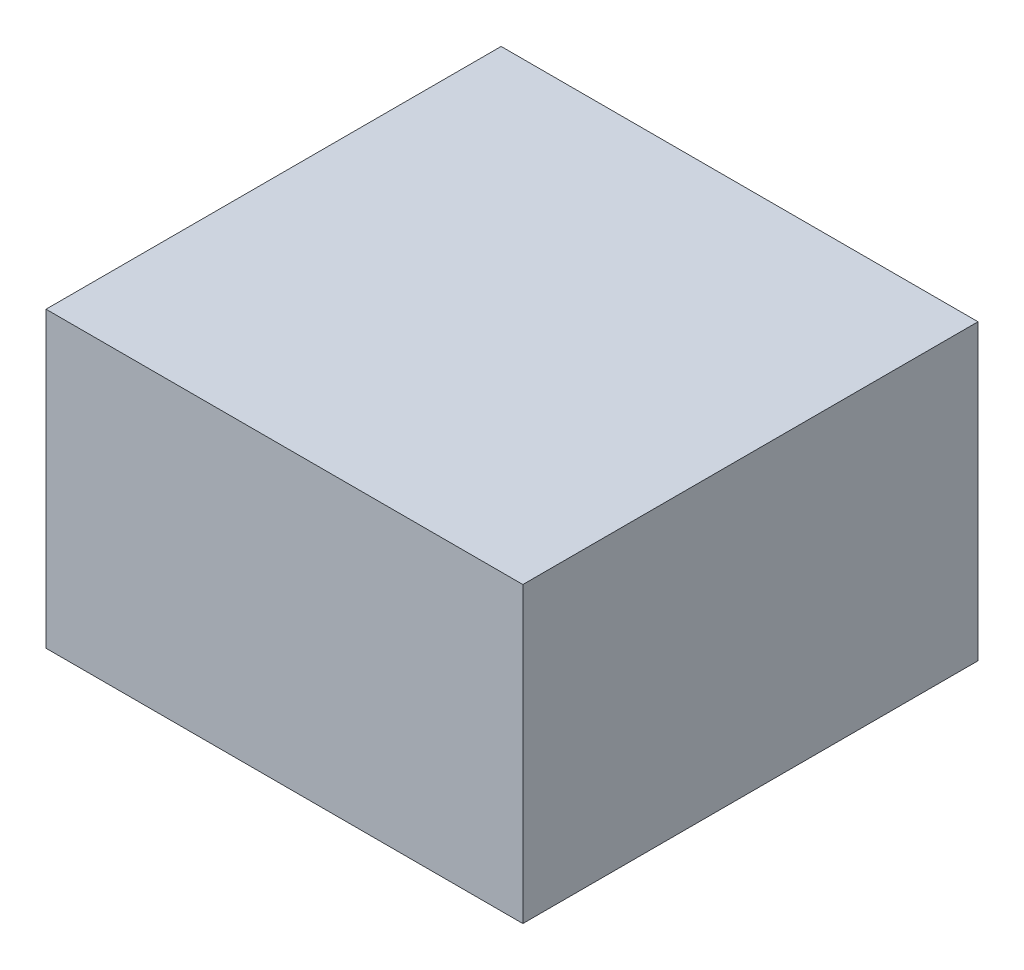
ISO-10303-21;
HEADER;
FILE_DESCRIPTION(('STEP AP214'),'2;1');
FILE_NAME('part.step','',(''),(''),'','','');
FILE_SCHEMA(('AUTOMOTIVE_DESIGN { 1 0 10303 214 1 1 1 1 }'));
ENDSEC;
DATA;
#1=APPLICATION_CONTEXT('core data for automotive mechanical design processes');
#2=APPLICATION_PROTOCOL_DEFINITION('international standard','automotive_design',2000,#1);
#3=PRODUCT_CONTEXT('',#1,'mechanical');
#4=PRODUCT('Part','Part','',(#3));
#5=PRODUCT_RELATED_PRODUCT_CATEGORY('part','',(#4));
#6=PRODUCT_DEFINITION_FORMATION('','',#4);
#7=PRODUCT_DEFINITION_CONTEXT('part definition',#1,'design');
#8=PRODUCT_DEFINITION('design','',#6,#7);
#9=PRODUCT_DEFINITION_SHAPE('','',#8);
#10=(LENGTH_UNIT() NAMED_UNIT(*) SI_UNIT(.MILLI.,.METRE.));
#11=(NAMED_UNIT(*) PLANE_ANGLE_UNIT() SI_UNIT($,.RADIAN.));
#12=(NAMED_UNIT(*) SI_UNIT($,.STERADIAN.) SOLID_ANGLE_UNIT());
#13=UNCERTAINTY_MEASURE_WITH_UNIT(LENGTH_MEASURE(1.E-05),#10,'distance_accuracy_value','');
#14=(GEOMETRIC_REPRESENTATION_CONTEXT(3) GLOBAL_UNCERTAINTY_ASSIGNED_CONTEXT((#13)) GLOBAL_UNIT_ASSIGNED_CONTEXT((#10,
#11,#12)) REPRESENTATION_CONTEXT('',''));
#15=CARTESIAN_POINT('',(0.,0.,0.));
#16=DIRECTION('',(0.,0.,1.));
#17=DIRECTION('',(1.,0.,0.));
#18=AXIS2_PLACEMENT_3D('',#15,#16,#17);
#19=CARTESIAN_POINT('',(0.,0.,7.75));
#20=DIRECTION('',(0.,0.,-1.));
#21=DIRECTION('',(-1.,0.,0.));
#22=AXIS2_PLACEMENT_3D('',#19,#20,#21);
#23=PLANE('',#22);
#24=DIRECTION('',(0.,1.,0.));
#25=VECTOR('',#24,1.);
#26=CARTESIAN_POINT('',(-4.06,-2.5,7.75));
#27=LINE('',#26,#25);
#28=CARTESIAN_POINT('',(-4.06,-2.5,7.75));
#29=VERTEX_POINT('',#28);
#30=CARTESIAN_POINT('',(-4.06,2.5,7.75));
#31=VERTEX_POINT('',#30);
#32=EDGE_CURVE('E27',#29,#31,#27,.T.);
#33=ORIENTED_EDGE('',*,*,#32,.F.);
#34=DIRECTION('',(-1.,0.,0.));
#35=VECTOR('',#34,1.);
#36=CARTESIAN_POINT('',(4.06,-2.5,7.75));
#37=LINE('',#36,#35);
#38=CARTESIAN_POINT('',(4.06,-2.5,7.75));
#39=VERTEX_POINT('',#38);
#40=EDGE_CURVE('E20',#39,#29,#37,.T.);
#41=ORIENTED_EDGE('',*,*,#40,.F.);
#42=DIRECTION('',(0.,-1.,0.));
#43=VECTOR('',#42,1.);
#44=CARTESIAN_POINT('',(4.06,2.5,7.75));
#45=LINE('',#44,#43);
#46=CARTESIAN_POINT('',(4.06,2.5,7.75));
#47=VERTEX_POINT('',#46);
#48=EDGE_CURVE('E69',#47,#39,#45,.T.);
#49=ORIENTED_EDGE('',*,*,#48,.F.);
#50=DIRECTION('',(1.,0.,0.));
#51=VECTOR('',#50,1.);
#52=CARTESIAN_POINT('',(-4.06,2.5,7.75));
#53=LINE('',#52,#51);
#54=EDGE_CURVE('E104',#31,#47,#53,.T.);
#55=ORIENTED_EDGE('',*,*,#54,.F.);
#56=EDGE_LOOP('',(#33,#41,#49,#55));
#57=FACE_BOUND('',#56,.T.);
#58=ADVANCED_FACE('F16',(#57),#23,.F.);
#59=CARTESIAN_POINT('',(0.,0.,0.));
#60=DIRECTION('',(0.,0.,-1.));
#61=DIRECTION('',(-1.,0.,0.));
#62=AXIS2_PLACEMENT_3D('',#59,#60,#61);
#63=PLANE('',#62);
#64=DIRECTION('',(1.,0.,0.));
#65=VECTOR('',#64,1.);
#66=CARTESIAN_POINT('',(-4.06,2.5,0.));
#67=LINE('',#66,#65);
#68=CARTESIAN_POINT('',(-4.06,2.5,0.));
#69=VERTEX_POINT('',#68);
#70=CARTESIAN_POINT('',(4.06,2.5,0.));
#71=VERTEX_POINT('',#70);
#72=EDGE_CURVE('E89',#69,#71,#67,.T.);
#73=ORIENTED_EDGE('',*,*,#72,.T.);
#74=DIRECTION('',(0.,-1.,0.));
#75=VECTOR('',#74,1.);
#76=CARTESIAN_POINT('',(4.06,2.5,0.));
#77=LINE('',#76,#75);
#78=CARTESIAN_POINT('',(4.06,-2.5,0.));
#79=VERTEX_POINT('',#78);
#80=EDGE_CURVE('E75',#71,#79,#77,.T.);
#81=ORIENTED_EDGE('',*,*,#80,.T.);
#82=DIRECTION('',(-1.,0.,0.));
#83=VECTOR('',#82,1.);
#84=CARTESIAN_POINT('',(4.06,-2.5,0.));
#85=LINE('',#84,#83);
#86=CARTESIAN_POINT('',(-4.06,-2.5,0.));
#87=VERTEX_POINT('',#86);
#88=EDGE_CURVE('E79',#79,#87,#85,.T.);
#89=ORIENTED_EDGE('',*,*,#88,.T.);
#90=DIRECTION('',(0.,1.,0.));
#91=VECTOR('',#90,1.);
#92=CARTESIAN_POINT('',(-4.06,-2.5,0.));
#93=LINE('',#92,#91);
#94=EDGE_CURVE('E11',#87,#69,#93,.T.);
#95=ORIENTED_EDGE('',*,*,#94,.T.);
#96=EDGE_LOOP('',(#73,#81,#89,#95));
#97=FACE_BOUND('',#96,.T.);
#98=ADVANCED_FACE('F123',(#97),#63,.T.);
#99=CARTESIAN_POINT('',(-4.06,-2.5,0.));
#100=DIRECTION('',(-1.,0.,0.));
#101=DIRECTION('',(0.,0.,1.));
#102=AXIS2_PLACEMENT_3D('',#99,#100,#101);
#103=PLANE('',#102);
#104=DIRECTION('',(0.,0.,1.));
#105=VECTOR('',#104,1.);
#106=CARTESIAN_POINT('',(-4.06,-2.5,0.));
#107=LINE('',#106,#105);
#108=EDGE_CURVE('E74',#87,#29,#107,.T.);
#109=ORIENTED_EDGE('',*,*,#108,.T.);
#110=ORIENTED_EDGE('',*,*,#32,.T.);
#111=DIRECTION('',(0.,0.,1.));
#112=VECTOR('',#111,1.);
#113=CARTESIAN_POINT('',(-4.06,2.5,0.));
#114=LINE('',#113,#112);
#115=EDGE_CURVE('E100',#69,#31,#114,.T.);
#116=ORIENTED_EDGE('',*,*,#115,.F.);
#117=ORIENTED_EDGE('',*,*,#94,.F.);
#118=EDGE_LOOP('',(#109,#110,#116,#117));
#119=FACE_BOUND('',#118,.T.);
#120=ADVANCED_FACE('F18',(#119),#103,.T.);
#121=CARTESIAN_POINT('',(4.06,-2.5,0.));
#122=DIRECTION('',(0.,-1.,0.));
#123=DIRECTION('',(0.,0.,-1.));
#124=AXIS2_PLACEMENT_3D('',#121,#122,#123);
#125=PLANE('',#124);
#126=DIRECTION('',(0.,0.,1.));
#127=VECTOR('',#126,1.);
#128=CARTESIAN_POINT('',(4.06,-2.5,0.));
#129=LINE('',#128,#127);
#130=EDGE_CURVE('E77',#79,#39,#129,.T.);
#131=ORIENTED_EDGE('',*,*,#130,.T.);
#132=ORIENTED_EDGE('',*,*,#40,.T.);
#133=ORIENTED_EDGE('',*,*,#108,.F.);
#134=ORIENTED_EDGE('',*,*,#88,.F.);
#135=EDGE_LOOP('',(#131,#132,#133,#134));
#136=FACE_BOUND('',#135,.T.);
#137=ADVANCED_FACE('F78',(#136),#125,.T.);
#138=CARTESIAN_POINT('',(4.06,2.5,0.));
#139=DIRECTION('',(1.,0.,0.));
#140=DIRECTION('',(0.,1.,0.));
#141=AXIS2_PLACEMENT_3D('',#138,#139,#140);
#142=PLANE('',#141);
#143=DIRECTION('',(0.,0.,1.));
#144=VECTOR('',#143,1.);
#145=CARTESIAN_POINT('',(4.06,2.5,0.));
#146=LINE('',#145,#144);
#147=EDGE_CURVE('E86',#71,#47,#146,.T.);
#148=ORIENTED_EDGE('',*,*,#147,.T.);
#149=ORIENTED_EDGE('',*,*,#48,.T.);
#150=ORIENTED_EDGE('',*,*,#130,.F.);
#151=ORIENTED_EDGE('',*,*,#80,.F.);
#152=EDGE_LOOP('',(#148,#149,#150,#151));
#153=FACE_BOUND('',#152,.T.);
#154=ADVANCED_FACE('F84',(#153),#142,.T.);
#155=CARTESIAN_POINT('',(-4.06,2.5,0.));
#156=DIRECTION('',(0.,1.,0.));
#157=DIRECTION('',(1.,0.,0.));
#158=AXIS2_PLACEMENT_3D('',#155,#156,#157);
#159=PLANE('',#158);
#160=ORIENTED_EDGE('',*,*,#115,.T.);
#161=ORIENTED_EDGE('',*,*,#54,.T.);
#162=ORIENTED_EDGE('',*,*,#147,.F.);
#163=ORIENTED_EDGE('',*,*,#72,.F.);
#164=EDGE_LOOP('',(#160,#161,#162,#163));
#165=FACE_BOUND('',#164,.T.);
#166=ADVANCED_FACE('F114',(#165),#159,.T.);
#167=CLOSED_SHELL('',(#58,#98,#120,#137,#154,#166));
#168=MANIFOLD_SOLID_BREP('B1',#167);
#169=ADVANCED_BREP_SHAPE_REPRESENTATION('',(#18,#168),#14);
#170=SHAPE_DEFINITION_REPRESENTATION(#9,#169);
ENDSEC;
END-ISO-10303-21;
